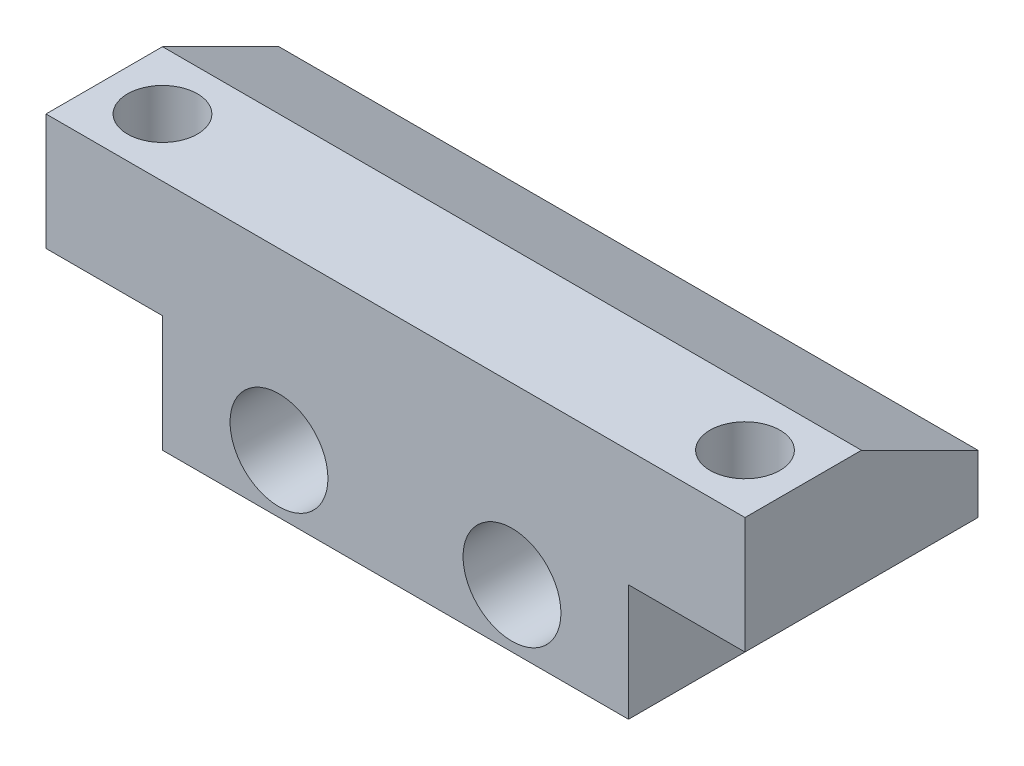
ISO-10303-21;
HEADER;
FILE_DESCRIPTION(('STEP AP214'),'2;1');
FILE_NAME('part.step','',(''),(''),'','','');
FILE_SCHEMA(('AUTOMOTIVE_DESIGN { 1 0 10303 214 1 1 1 1 }'));
ENDSEC;
DATA;
#1=APPLICATION_CONTEXT('core data for automotive mechanical design processes');
#2=APPLICATION_PROTOCOL_DEFINITION('international standard','automotive_design',2000,#1);
#3=PRODUCT_CONTEXT('',#1,'mechanical');
#4=PRODUCT('Part','Part','',(#3));
#5=PRODUCT_RELATED_PRODUCT_CATEGORY('part','',(#4));
#6=PRODUCT_DEFINITION_FORMATION('','',#4);
#7=PRODUCT_DEFINITION_CONTEXT('part definition',#1,'design');
#8=PRODUCT_DEFINITION('design','',#6,#7);
#9=PRODUCT_DEFINITION_SHAPE('','',#8);
#10=(LENGTH_UNIT() NAMED_UNIT(*) SI_UNIT(.MILLI.,.METRE.));
#11=(NAMED_UNIT(*) PLANE_ANGLE_UNIT() SI_UNIT($,.RADIAN.));
#12=(NAMED_UNIT(*) SI_UNIT($,.STERADIAN.) SOLID_ANGLE_UNIT());
#13=UNCERTAINTY_MEASURE_WITH_UNIT(LENGTH_MEASURE(1.E-05),#10,'distance_accuracy_value','');
#14=(GEOMETRIC_REPRESENTATION_CONTEXT(3) GLOBAL_UNCERTAINTY_ASSIGNED_CONTEXT((#13)) GLOBAL_UNIT_ASSIGNED_CONTEXT((#10,
#11,#12)) REPRESENTATION_CONTEXT('',''));
#15=CARTESIAN_POINT('',(0.,0.,0.));
#16=DIRECTION('',(0.,0.,1.));
#17=DIRECTION('',(1.,0.,0.));
#18=AXIS2_PLACEMENT_3D('',#15,#16,#17);
#19=CARTESIAN_POINT('',(0.,0.,0.));
#20=DIRECTION('',(0.,-1.,0.));
#21=DIRECTION('',(0.,0.,-1.));
#22=AXIS2_PLACEMENT_3D('',#19,#20,#21);
#23=PLANE('',#22);
#24=CARTESIAN_POINT('',(2.5,0.,-2.5));
#25=DIRECTION('',(0.,1.,0.));
#26=DIRECTION('',(0.,0.,1.));
#27=AXIS2_PLACEMENT_3D('',#24,#25,#26);
#28=CIRCLE('',#27,1.5);
#29=CARTESIAN_POINT('',(2.5,0.,-0.999999999999999));
#30=VERTEX_POINT('',#29);
#31=EDGE_CURVE('E172',#30,#30,#28,.T.);
#32=ORIENTED_EDGE('',*,*,#31,.T.);
#33=EDGE_LOOP('',(#32));
#34=FACE_BOUND('',#33,.T.);
#35=DIRECTION('',(0.,0.,-1.));
#36=VECTOR('',#35,1.);
#37=CARTESIAN_POINT('',(4.99999999999999,0.,0.));
#38=LINE('',#37,#36);
#39=CARTESIAN_POINT('',(4.99999999999999,0.,0.));
#40=VERTEX_POINT('',#39);
#41=CARTESIAN_POINT('',(4.99999999999999,0.,-10.));
#42=VERTEX_POINT('',#41);
#43=EDGE_CURVE('E193',#40,#42,#38,.T.);
#44=ORIENTED_EDGE('',*,*,#43,.F.);
#45=DIRECTION('',(1.,0.,0.));
#46=VECTOR('',#45,1.);
#47=CARTESIAN_POINT('',(0.,0.,0.));
#48=LINE('',#47,#46);
#49=CARTESIAN_POINT('',(0.,0.,0.));
#50=VERTEX_POINT('',#49);
#51=EDGE_CURVE('E236',#50,#40,#48,.T.);
#52=ORIENTED_EDGE('',*,*,#51,.F.);
#53=DIRECTION('',(0.,0.,1.));
#54=VECTOR('',#53,1.);
#55=CARTESIAN_POINT('',(0.,0.,0.));
#56=LINE('',#55,#54);
#57=CARTESIAN_POINT('',(0.,0.,-10.));
#58=VERTEX_POINT('',#57);
#59=EDGE_CURVE('E223',#58,#50,#56,.T.);
#60=ORIENTED_EDGE('',*,*,#59,.F.);
#61=DIRECTION('',(-1.,0.,0.));
#62=VECTOR('',#61,1.);
#63=CARTESIAN_POINT('',(0.,0.,-10.));
#64=LINE('',#63,#62);
#65=EDGE_CURVE('E242',#42,#58,#64,.T.);
#66=ORIENTED_EDGE('',*,*,#65,.F.);
#67=EDGE_LOOP('',(#44,#52,#60,#66));
#68=FACE_BOUND('',#67,.T.);
#69=ADVANCED_FACE('F38',(#34,#68),#23,.T.);
#70=CARTESIAN_POINT('',(0.,5.,0.));
#71=DIRECTION('',(1.,0.,0.));
#72=DIRECTION('',(0.,0.,-1.));
#73=AXIS2_PLACEMENT_3D('',#70,#71,#72);
#74=PLANE('',#73);
#75=DIRECTION('',(0.,0.,1.));
#76=VECTOR('',#75,1.);
#77=CARTESIAN_POINT('',(0.,5.,0.));
#78=LINE('',#77,#76);
#79=CARTESIAN_POINT('',(0.,5.,-4.99999999999996));
#80=VERTEX_POINT('',#79);
#81=CARTESIAN_POINT('',(0.,5.,0.));
#82=VERTEX_POINT('',#81);
#83=EDGE_CURVE('E224',#80,#82,#78,.T.);
#84=ORIENTED_EDGE('',*,*,#83,.F.);
#85=DIRECTION('',(0.,0.447213595499956,0.894427190999917));
#86=VECTOR('',#85,1.);
#87=CARTESIAN_POINT('',(0.,5.,-4.99999999999996));
#88=LINE('',#87,#86);
#89=CARTESIAN_POINT('',(0.,2.5,-10.));
#90=VERTEX_POINT('',#89);
#91=EDGE_CURVE('E61',#80,#90,#88,.F.);
#92=ORIENTED_EDGE('',*,*,#91,.T.);
#93=DIRECTION('',(0.,-1.,0.));
#94=VECTOR('',#93,1.);
#95=CARTESIAN_POINT('',(0.,5.,-10.));
#96=LINE('',#95,#94);
#97=EDGE_CURVE('E232',#90,#58,#96,.T.);
#98=ORIENTED_EDGE('',*,*,#97,.T.);
#99=ORIENTED_EDGE('',*,*,#59,.T.);
#100=DIRECTION('',(0.,-1.,0.));
#101=VECTOR('',#100,1.);
#102=CARTESIAN_POINT('',(0.,5.,0.));
#103=LINE('',#102,#101);
#104=EDGE_CURVE('E251',#82,#50,#103,.T.);
#105=ORIENTED_EDGE('',*,*,#104,.F.);
#106=EDGE_LOOP('',(#84,#92,#98,#99,#105));
#107=FACE_BOUND('',#106,.T.);
#108=ADVANCED_FACE('F265',(#107),#74,.F.);
#109=CARTESIAN_POINT('',(0.,5.,0.));
#110=DIRECTION('',(0.,0.,-1.));
#111=DIRECTION('',(-1.,0.,0.));
#112=AXIS2_PLACEMENT_3D('',#109,#110,#111);
#113=PLANE('',#112);
#114=CARTESIAN_POINT('',(9.99999999999999,-2.5,0.));
#115=DIRECTION('',(0.,0.,1.));
#116=DIRECTION('',(1.,0.,0.));
#117=AXIS2_PLACEMENT_3D('',#114,#115,#116);
#118=CIRCLE('',#117,2.1);
#119=CARTESIAN_POINT('',(12.1,-2.5,0.));
#120=VERTEX_POINT('',#119);
#121=EDGE_CURVE('E181',#120,#120,#118,.T.);
#122=ORIENTED_EDGE('',*,*,#121,.F.);
#123=EDGE_LOOP('',(#122));
#124=FACE_BOUND('',#123,.T.);
#125=CARTESIAN_POINT('',(20.,-2.5,0.));
#126=DIRECTION('',(0.,0.,1.));
#127=DIRECTION('',(1.,0.,0.));
#128=AXIS2_PLACEMENT_3D('',#125,#126,#127);
#129=CIRCLE('',#128,2.1);
#130=CARTESIAN_POINT('',(22.1,-2.5,0.));
#131=VERTEX_POINT('',#130);
#132=EDGE_CURVE('E187',#131,#131,#129,.T.);
#133=ORIENTED_EDGE('',*,*,#132,.F.);
#134=EDGE_LOOP('',(#133));
#135=FACE_BOUND('',#134,.T.);
#136=ORIENTED_EDGE('',*,*,#51,.T.);
#137=DIRECTION('',(0.,1.,0.));
#138=VECTOR('',#137,1.);
#139=CARTESIAN_POINT('',(4.99999999999999,-5.,0.));
#140=LINE('',#139,#138);
#141=CARTESIAN_POINT('',(4.99999999999999,-5.,0.));
#142=VERTEX_POINT('',#141);
#143=EDGE_CURVE('E207',#142,#40,#140,.T.);
#144=ORIENTED_EDGE('',*,*,#143,.F.);
#145=DIRECTION('',(-1.,0.,0.));
#146=VECTOR('',#145,1.);
#147=CARTESIAN_POINT('',(4.99999999999999,-5.,0.));
#148=LINE('',#147,#146);
#149=CARTESIAN_POINT('',(25.,-5.,0.));
#150=VERTEX_POINT('',#149);
#151=EDGE_CURVE('E205',#150,#142,#148,.T.);
#152=ORIENTED_EDGE('',*,*,#151,.F.);
#153=DIRECTION('',(0.,1.,0.));
#154=VECTOR('',#153,1.);
#155=CARTESIAN_POINT('',(25.,-5.,0.));
#156=LINE('',#155,#154);
#157=CARTESIAN_POINT('',(25.,0.,0.));
#158=VERTEX_POINT('',#157);
#159=EDGE_CURVE('E214',#150,#158,#156,.T.);
#160=ORIENTED_EDGE('',*,*,#159,.T.);
#161=CARTESIAN_POINT('',(30.,0.,0.));
#162=VERTEX_POINT('',#161);
#163=EDGE_CURVE('E235',#158,#162,#48,.T.);
#164=ORIENTED_EDGE('',*,*,#163,.T.);
#165=DIRECTION('',(0.,-1.,0.));
#166=VECTOR('',#165,1.);
#167=CARTESIAN_POINT('',(30.,5.,0.));
#168=LINE('',#167,#166);
#169=CARTESIAN_POINT('',(30.,5.,0.));
#170=VERTEX_POINT('',#169);
#171=EDGE_CURVE('E248',#170,#162,#168,.T.);
#172=ORIENTED_EDGE('',*,*,#171,.F.);
#173=DIRECTION('',(1.,0.,0.));
#174=VECTOR('',#173,1.);
#175=CARTESIAN_POINT('',(0.,5.,0.));
#176=LINE('',#175,#174);
#177=EDGE_CURVE('E226',#82,#170,#176,.T.);
#178=ORIENTED_EDGE('',*,*,#177,.F.);
#179=ORIENTED_EDGE('',*,*,#104,.T.);
#180=EDGE_LOOP('',(#136,#144,#152,#160,#164,#172,#178,#179));
#181=FACE_BOUND('',#180,.T.);
#182=ADVANCED_FACE('F268',(#124,#135,#181),#113,.F.);
#183=CARTESIAN_POINT('',(30.,5.,0.));
#184=DIRECTION('',(-1.,0.,0.));
#185=DIRECTION('',(0.,0.,1.));
#186=AXIS2_PLACEMENT_3D('',#183,#184,#185);
#187=PLANE('',#186);
#188=DIRECTION('',(0.,-1.,0.));
#189=VECTOR('',#188,1.);
#190=CARTESIAN_POINT('',(30.,5.,-10.));
#191=LINE('',#190,#189);
#192=CARTESIAN_POINT('',(30.,2.5,-10.));
#193=VERTEX_POINT('',#192);
#194=CARTESIAN_POINT('',(30.,0.,-10.));
#195=VERTEX_POINT('',#194);
#196=EDGE_CURVE('E246',#193,#195,#191,.T.);
#197=ORIENTED_EDGE('',*,*,#196,.F.);
#198=DIRECTION('',(0.,-0.447213595499956,-0.894427190999917));
#199=VECTOR('',#198,1.);
#200=CARTESIAN_POINT('',(30.,4.99999999999999,-4.99999999999998));
#201=LINE('',#200,#199);
#202=CARTESIAN_POINT('',(30.,5.,-4.99999999999996));
#203=VERTEX_POINT('',#202);
#204=EDGE_CURVE('E11',#193,#203,#201,.F.);
#205=ORIENTED_EDGE('',*,*,#204,.T.);
#206=DIRECTION('',(0.,0.,-1.));
#207=VECTOR('',#206,1.);
#208=CARTESIAN_POINT('',(30.,5.,0.));
#209=LINE('',#208,#207);
#210=EDGE_CURVE('E229',#170,#203,#209,.T.);
#211=ORIENTED_EDGE('',*,*,#210,.F.);
#212=ORIENTED_EDGE('',*,*,#171,.T.);
#213=DIRECTION('',(0.,0.,-1.));
#214=VECTOR('',#213,1.);
#215=CARTESIAN_POINT('',(30.,0.,0.));
#216=LINE('',#215,#214);
#217=EDGE_CURVE('E239',#162,#195,#216,.T.);
#218=ORIENTED_EDGE('',*,*,#217,.T.);
#219=EDGE_LOOP('',(#197,#205,#211,#212,#218));
#220=FACE_BOUND('',#219,.T.);
#221=ADVANCED_FACE('F273',(#220),#187,.F.);
#222=CARTESIAN_POINT('',(0.,5.,-10.));
#223=DIRECTION('',(0.,0.,1.));
#224=DIRECTION('',(1.,0.,0.));
#225=AXIS2_PLACEMENT_3D('',#222,#223,#224);
#226=PLANE('',#225);
#227=CARTESIAN_POINT('',(9.99999999999999,-2.5,-10.));
#228=DIRECTION('',(0.,0.,1.));
#229=DIRECTION('',(1.,0.,0.));
#230=AXIS2_PLACEMENT_3D('',#227,#228,#229);
#231=CIRCLE('',#230,2.1);
#232=CARTESIAN_POINT('',(12.1,-2.5,-10.));
#233=VERTEX_POINT('',#232);
#234=EDGE_CURVE('E184',#233,#233,#231,.T.);
#235=ORIENTED_EDGE('',*,*,#234,.T.);
#236=EDGE_LOOP('',(#235));
#237=FACE_BOUND('',#236,.T.);
#238=CARTESIAN_POINT('',(20.,-2.5,-10.));
#239=DIRECTION('',(0.,0.,1.));
#240=DIRECTION('',(1.,0.,0.));
#241=AXIS2_PLACEMENT_3D('',#238,#239,#240);
#242=CIRCLE('',#241,2.1);
#243=CARTESIAN_POINT('',(22.1,-2.5,-10.));
#244=VERTEX_POINT('',#243);
#245=EDGE_CURVE('E190',#244,#244,#242,.T.);
#246=ORIENTED_EDGE('',*,*,#245,.T.);
#247=EDGE_LOOP('',(#246));
#248=FACE_BOUND('',#247,.T.);
#249=ORIENTED_EDGE('',*,*,#97,.F.);
#250=DIRECTION('',(1.,0.,0.));
#251=VECTOR('',#250,1.);
#252=CARTESIAN_POINT('',(0.,2.5,-10.));
#253=LINE('',#252,#251);
#254=EDGE_CURVE('E47',#90,#193,#253,.T.);
#255=ORIENTED_EDGE('',*,*,#254,.T.);
#256=ORIENTED_EDGE('',*,*,#196,.T.);
#257=CARTESIAN_POINT('',(25.,0.,-10.));
#258=VERTEX_POINT('',#257);
#259=EDGE_CURVE('E227',#195,#258,#64,.T.);
#260=ORIENTED_EDGE('',*,*,#259,.T.);
#261=DIRECTION('',(0.,1.,0.));
#262=VECTOR('',#261,1.);
#263=CARTESIAN_POINT('',(25.,-5.,-10.));
#264=LINE('',#263,#262);
#265=CARTESIAN_POINT('',(25.,-5.,-10.));
#266=VERTEX_POINT('',#265);
#267=EDGE_CURVE('E217',#266,#258,#264,.T.);
#268=ORIENTED_EDGE('',*,*,#267,.F.);
#269=DIRECTION('',(1.,0.,0.));
#270=VECTOR('',#269,1.);
#271=CARTESIAN_POINT('',(4.99999999999999,-5.,-10.));
#272=LINE('',#271,#270);
#273=CARTESIAN_POINT('',(15.75,-5.,-10.));
#274=VERTEX_POINT('',#273);
#275=EDGE_CURVE('E199',#274,#266,#272,.T.);
#276=ORIENTED_EDGE('',*,*,#275,.F.);
#277=DIRECTION('',(0.,-1.,0.));
#278=VECTOR('',#277,1.);
#279=CARTESIAN_POINT('',(15.75,0.,-10.));
#280=LINE('',#279,#278);
#281=CARTESIAN_POINT('',(15.75,0.,-10.));
#282=VERTEX_POINT('',#281);
#283=EDGE_CURVE('E141',#282,#274,#280,.T.);
#284=ORIENTED_EDGE('',*,*,#283,.F.);
#285=DIRECTION('',(1.,0.,0.));
#286=VECTOR('',#285,1.);
#287=CARTESIAN_POINT('',(14.25,0.,-10.));
#288=LINE('',#287,#286);
#289=CARTESIAN_POINT('',(14.25,0.,-10.));
#290=VERTEX_POINT('',#289);
#291=EDGE_CURVE('E148',#290,#282,#288,.T.);
#292=ORIENTED_EDGE('',*,*,#291,.F.);
#293=DIRECTION('',(0.,-1.,0.));
#294=VECTOR('',#293,1.);
#295=CARTESIAN_POINT('',(14.25,0.,-10.));
#296=LINE('',#295,#294);
#297=CARTESIAN_POINT('',(14.25,-5.,-10.));
#298=VERTEX_POINT('',#297);
#299=EDGE_CURVE('E132',#290,#298,#296,.T.);
#300=ORIENTED_EDGE('',*,*,#299,.T.);
#301=CARTESIAN_POINT('',(4.99999999999999,-5.,-10.));
#302=VERTEX_POINT('',#301);
#303=EDGE_CURVE('E201',#302,#298,#272,.T.);
#304=ORIENTED_EDGE('',*,*,#303,.F.);
#305=DIRECTION('',(0.,1.,0.));
#306=VECTOR('',#305,1.);
#307=CARTESIAN_POINT('',(4.99999999999999,-5.,-10.));
#308=LINE('',#307,#306);
#309=EDGE_CURVE('E220',#302,#42,#308,.T.);
#310=ORIENTED_EDGE('',*,*,#309,.T.);
#311=ORIENTED_EDGE('',*,*,#65,.T.);
#312=EDGE_LOOP('',(#249,#255,#256,#260,#268,#276,#284,#292,#300,#304,#310,#311));
#313=FACE_BOUND('',#312,.T.);
#314=ADVANCED_FACE('F153',(#237,#248,#313),#226,.F.);
#315=CARTESIAN_POINT('',(0.,5.,0.));
#316=DIRECTION('',(0.,-1.,0.));
#317=DIRECTION('',(0.,0.,-1.));
#318=AXIS2_PLACEMENT_3D('',#315,#316,#317);
#319=PLANE('',#318);
#320=CARTESIAN_POINT('',(2.5,5.,-2.5));
#321=DIRECTION('',(0.,1.,0.));
#322=DIRECTION('',(0.,0.,1.));
#323=AXIS2_PLACEMENT_3D('',#320,#321,#322);
#324=CIRCLE('',#323,1.5);
#325=CARTESIAN_POINT('',(2.5,5.,-0.999999999999999));
#326=VERTEX_POINT('',#325);
#327=EDGE_CURVE('E168',#326,#326,#324,.T.);
#328=ORIENTED_EDGE('',*,*,#327,.F.);
#329=EDGE_LOOP('',(#328));
#330=FACE_BOUND('',#329,.T.);
#331=CARTESIAN_POINT('',(27.5,5.,-2.5));
#332=DIRECTION('',(0.,1.,0.));
#333=DIRECTION('',(0.,0.,1.));
#334=AXIS2_PLACEMENT_3D('',#331,#332,#333);
#335=CIRCLE('',#334,1.5);
#336=CARTESIAN_POINT('',(27.5,5.,-0.999999999999999));
#337=VERTEX_POINT('',#336);
#338=EDGE_CURVE('E175',#337,#337,#335,.T.);
#339=ORIENTED_EDGE('',*,*,#338,.F.);
#340=EDGE_LOOP('',(#339));
#341=FACE_BOUND('',#340,.T.);
#342=ORIENTED_EDGE('',*,*,#210,.T.);
#343=DIRECTION('',(-1.,0.,0.));
#344=VECTOR('',#343,1.);
#345=CARTESIAN_POINT('',(0.,5.,-4.99999999999996));
#346=LINE('',#345,#344);
#347=EDGE_CURVE('E254',#203,#80,#346,.T.);
#348=ORIENTED_EDGE('',*,*,#347,.T.);
#349=ORIENTED_EDGE('',*,*,#83,.T.);
#350=ORIENTED_EDGE('',*,*,#177,.T.);
#351=EDGE_LOOP('',(#342,#348,#349,#350));
#352=FACE_BOUND('',#351,.T.);
#353=ADVANCED_FACE('F259',(#330,#341,#352),#319,.F.);
#354=CARTESIAN_POINT('',(27.5,0.,-2.5));
#355=DIRECTION('',(0.,1.,0.));
#356=DIRECTION('',(0.,0.,1.));
#357=AXIS2_PLACEMENT_3D('',#354,#355,#356);
#358=CIRCLE('',#357,1.5);
#359=CARTESIAN_POINT('',(27.5,0.,-0.999999999999999));
#360=VERTEX_POINT('',#359);
#361=EDGE_CURVE('E178',#360,#360,#358,.T.);
#362=ORIENTED_EDGE('',*,*,#361,.T.);
#363=EDGE_LOOP('',(#362));
#364=FACE_BOUND('',#363,.T.);
#365=DIRECTION('',(0.,0.,1.));
#366=VECTOR('',#365,1.);
#367=CARTESIAN_POINT('',(25.,0.,0.));
#368=LINE('',#367,#366);
#369=EDGE_CURVE('E200',#258,#158,#368,.T.);
#370=ORIENTED_EDGE('',*,*,#369,.F.);
#371=ORIENTED_EDGE('',*,*,#259,.F.);
#372=ORIENTED_EDGE('',*,*,#217,.F.);
#373=ORIENTED_EDGE('',*,*,#163,.F.);
#374=EDGE_LOOP('',(#370,#371,#372,#373));
#375=FACE_BOUND('',#374,.T.);
#376=ADVANCED_FACE('F283',(#364,#375),#23,.T.);
#377=CARTESIAN_POINT('',(4.99999999999999,-5.,0.));
#378=DIRECTION('',(1.,0.,0.));
#379=DIRECTION('',(0.,0.,-1.));
#380=AXIS2_PLACEMENT_3D('',#377,#378,#379);
#381=PLANE('',#380);
#382=ORIENTED_EDGE('',*,*,#43,.T.);
#383=ORIENTED_EDGE('',*,*,#309,.F.);
#384=DIRECTION('',(0.,0.,-1.));
#385=VECTOR('',#384,1.);
#386=CARTESIAN_POINT('',(4.99999999999999,-5.,0.));
#387=LINE('',#386,#385);
#388=EDGE_CURVE('E196',#142,#302,#387,.T.);
#389=ORIENTED_EDGE('',*,*,#388,.F.);
#390=ORIENTED_EDGE('',*,*,#143,.T.);
#391=EDGE_LOOP('',(#382,#383,#389,#390));
#392=FACE_BOUND('',#391,.T.);
#393=ADVANCED_FACE('F291',(#392),#381,.F.);
#394=CARTESIAN_POINT('',(25.,-5.,0.));
#395=DIRECTION('',(-1.,0.,0.));
#396=DIRECTION('',(0.,0.,1.));
#397=AXIS2_PLACEMENT_3D('',#394,#395,#396);
#398=PLANE('',#397);
#399=ORIENTED_EDGE('',*,*,#369,.T.);
#400=ORIENTED_EDGE('',*,*,#159,.F.);
#401=DIRECTION('',(0.,0.,1.));
#402=VECTOR('',#401,1.);
#403=CARTESIAN_POINT('',(25.,-5.,0.));
#404=LINE('',#403,#402);
#405=EDGE_CURVE('E203',#266,#150,#404,.T.);
#406=ORIENTED_EDGE('',*,*,#405,.F.);
#407=ORIENTED_EDGE('',*,*,#267,.T.);
#408=EDGE_LOOP('',(#399,#400,#406,#407));
#409=FACE_BOUND('',#408,.T.);
#410=ADVANCED_FACE('F297',(#409),#398,.F.);
#411=CARTESIAN_POINT('',(0.,-5.,0.));
#412=DIRECTION('',(0.,-1.,0.));
#413=DIRECTION('',(0.,0.,-1.));
#414=AXIS2_PLACEMENT_3D('',#411,#412,#413);
#415=PLANE('',#414);
#416=DIRECTION('',(0.,0.,-1.));
#417=VECTOR('',#416,1.);
#418=CARTESIAN_POINT('',(14.25,-5.,-10.));
#419=LINE('',#418,#417);
#420=CARTESIAN_POINT('',(14.25,-5.,-8.5));
#421=VERTEX_POINT('',#420);
#422=EDGE_CURVE('E138',#421,#298,#419,.T.);
#423=ORIENTED_EDGE('',*,*,#422,.F.);
#424=DIRECTION('',(-1.,0.,0.));
#425=VECTOR('',#424,1.);
#426=CARTESIAN_POINT('',(14.25,-5.,-8.5));
#427=LINE('',#426,#425);
#428=CARTESIAN_POINT('',(15.75,-5.,-8.5));
#429=VERTEX_POINT('',#428);
#430=EDGE_CURVE('E151',#429,#421,#427,.T.);
#431=ORIENTED_EDGE('',*,*,#430,.F.);
#432=DIRECTION('',(0.,0.,1.));
#433=VECTOR('',#432,1.);
#434=CARTESIAN_POINT('',(15.75,-5.,-10.));
#435=LINE('',#434,#433);
#436=EDGE_CURVE('E161',#274,#429,#435,.T.);
#437=ORIENTED_EDGE('',*,*,#436,.F.);
#438=ORIENTED_EDGE('',*,*,#275,.T.);
#439=ORIENTED_EDGE('',*,*,#405,.T.);
#440=ORIENTED_EDGE('',*,*,#151,.T.);
#441=ORIENTED_EDGE('',*,*,#388,.T.);
#442=ORIENTED_EDGE('',*,*,#303,.T.);
#443=EDGE_LOOP('',(#423,#431,#437,#438,#439,#440,#441,#442));
#444=FACE_BOUND('',#443,.T.);
#445=ADVANCED_FACE('F310',(#444),#415,.T.);
#446=CARTESIAN_POINT('',(20.,-2.5,-10.));
#447=DIRECTION('',(0.,0.,1.));
#448=DIRECTION('',(1.,0.,0.));
#449=AXIS2_PLACEMENT_3D('',#446,#447,#448);
#450=CYLINDRICAL_SURFACE('',#449,2.1);
#451=ORIENTED_EDGE('',*,*,#245,.F.);
#452=EDGE_LOOP('',(#451));
#453=FACE_BOUND('',#452,.T.);
#454=ORIENTED_EDGE('',*,*,#132,.T.);
#455=EDGE_LOOP('',(#454));
#456=FACE_BOUND('',#455,.T.);
#457=ADVANCED_FACE('F339',(#453,#456),#450,.F.);
#458=CARTESIAN_POINT('',(9.99999999999999,-2.5,-10.));
#459=DIRECTION('',(0.,0.,1.));
#460=DIRECTION('',(1.,0.,0.));
#461=AXIS2_PLACEMENT_3D('',#458,#459,#460);
#462=CYLINDRICAL_SURFACE('',#461,2.1);
#463=ORIENTED_EDGE('',*,*,#234,.F.);
#464=EDGE_LOOP('',(#463));
#465=FACE_BOUND('',#464,.T.);
#466=ORIENTED_EDGE('',*,*,#121,.T.);
#467=EDGE_LOOP('',(#466));
#468=FACE_BOUND('',#467,.T.);
#469=ADVANCED_FACE('F335',(#465,#468),#462,.F.);
#470=CARTESIAN_POINT('',(27.5,0.,-2.5));
#471=DIRECTION('',(0.,1.,0.));
#472=DIRECTION('',(0.,0.,1.));
#473=AXIS2_PLACEMENT_3D('',#470,#471,#472);
#474=CYLINDRICAL_SURFACE('',#473,1.5);
#475=ORIENTED_EDGE('',*,*,#361,.F.);
#476=EDGE_LOOP('',(#475));
#477=FACE_BOUND('',#476,.T.);
#478=ORIENTED_EDGE('',*,*,#338,.T.);
#479=EDGE_LOOP('',(#478));
#480=FACE_BOUND('',#479,.T.);
#481=ADVANCED_FACE('F331',(#477,#480),#474,.F.);
#482=CARTESIAN_POINT('',(2.5,0.,-2.5));
#483=DIRECTION('',(0.,1.,0.));
#484=DIRECTION('',(0.,0.,1.));
#485=AXIS2_PLACEMENT_3D('',#482,#483,#484);
#486=CYLINDRICAL_SURFACE('',#485,1.5);
#487=ORIENTED_EDGE('',*,*,#31,.F.);
#488=EDGE_LOOP('',(#487));
#489=FACE_BOUND('',#488,.T.);
#490=ORIENTED_EDGE('',*,*,#327,.T.);
#491=EDGE_LOOP('',(#490));
#492=FACE_BOUND('',#491,.T.);
#493=ADVANCED_FACE('F326',(#489,#492),#486,.F.);
#494=CARTESIAN_POINT('',(14.25,0.,-10.));
#495=DIRECTION('',(-1.,0.,0.));
#496=DIRECTION('',(0.,0.,1.));
#497=AXIS2_PLACEMENT_3D('',#494,#495,#496);
#498=PLANE('',#497);
#499=ORIENTED_EDGE('',*,*,#422,.T.);
#500=ORIENTED_EDGE('',*,*,#299,.F.);
#501=DIRECTION('',(0.,0.,-1.));
#502=VECTOR('',#501,1.);
#503=CARTESIAN_POINT('',(14.25,0.,-10.));
#504=LINE('',#503,#502);
#505=CARTESIAN_POINT('',(14.25,0.,-8.5));
#506=VERTEX_POINT('',#505);
#507=EDGE_CURVE('E135',#506,#290,#504,.T.);
#508=ORIENTED_EDGE('',*,*,#507,.F.);
#509=DIRECTION('',(0.,-1.,0.));
#510=VECTOR('',#509,1.);
#511=CARTESIAN_POINT('',(14.25,0.,-8.5));
#512=LINE('',#511,#510);
#513=EDGE_CURVE('E166',#506,#421,#512,.T.);
#514=ORIENTED_EDGE('',*,*,#513,.T.);
#515=EDGE_LOOP('',(#499,#500,#508,#514));
#516=FACE_BOUND('',#515,.T.);
#517=ADVANCED_FACE('F134',(#516),#498,.F.);
#518=CARTESIAN_POINT('',(14.25,0.,-8.5));
#519=DIRECTION('',(0.,0.,1.));
#520=DIRECTION('',(1.,0.,0.));
#521=AXIS2_PLACEMENT_3D('',#518,#519,#520);
#522=PLANE('',#521);
#523=ORIENTED_EDGE('',*,*,#430,.T.);
#524=ORIENTED_EDGE('',*,*,#513,.F.);
#525=DIRECTION('',(-1.,0.,0.));
#526=VECTOR('',#525,1.);
#527=CARTESIAN_POINT('',(14.25,0.,-8.5));
#528=LINE('',#527,#526);
#529=CARTESIAN_POINT('',(15.75,0.,-8.5));
#530=VERTEX_POINT('',#529);
#531=EDGE_CURVE('E142',#530,#506,#528,.T.);
#532=ORIENTED_EDGE('',*,*,#531,.F.);
#533=DIRECTION('',(0.,-1.,0.));
#534=VECTOR('',#533,1.);
#535=CARTESIAN_POINT('',(15.75,0.,-8.5));
#536=LINE('',#535,#534);
#537=EDGE_CURVE('E169',#530,#429,#536,.T.);
#538=ORIENTED_EDGE('',*,*,#537,.T.);
#539=EDGE_LOOP('',(#523,#524,#532,#538));
#540=FACE_BOUND('',#539,.T.);
#541=ADVANCED_FACE('F315',(#540),#522,.F.);
#542=CARTESIAN_POINT('',(15.75,0.,-10.));
#543=DIRECTION('',(1.,0.,0.));
#544=DIRECTION('',(0.,0.,-1.));
#545=AXIS2_PLACEMENT_3D('',#542,#543,#544);
#546=PLANE('',#545);
#547=ORIENTED_EDGE('',*,*,#436,.T.);
#548=ORIENTED_EDGE('',*,*,#537,.F.);
#549=DIRECTION('',(0.,0.,1.));
#550=VECTOR('',#549,1.);
#551=CARTESIAN_POINT('',(15.75,0.,-10.));
#552=LINE('',#551,#550);
#553=EDGE_CURVE('E155',#282,#530,#552,.T.);
#554=ORIENTED_EDGE('',*,*,#553,.F.);
#555=ORIENTED_EDGE('',*,*,#283,.T.);
#556=EDGE_LOOP('',(#547,#548,#554,#555));
#557=FACE_BOUND('',#556,.T.);
#558=ADVANCED_FACE('F278',(#557),#546,.F.);
#559=CARTESIAN_POINT('',(0.,0.,0.));
#560=DIRECTION('',(0.,1.,0.));
#561=DIRECTION('',(0.,0.,1.));
#562=AXIS2_PLACEMENT_3D('',#559,#560,#561);
#563=PLANE('',#562);
#564=ORIENTED_EDGE('',*,*,#507,.T.);
#565=ORIENTED_EDGE('',*,*,#291,.T.);
#566=ORIENTED_EDGE('',*,*,#553,.T.);
#567=ORIENTED_EDGE('',*,*,#531,.T.);
#568=EDGE_LOOP('',(#564,#565,#566,#567));
#569=FACE_BOUND('',#568,.T.);
#570=ADVANCED_FACE('F146',(#569),#563,.F.);
#571=CARTESIAN_POINT('',(0.,5.,-4.99999999999996));
#572=DIRECTION('',(0.,-0.894427190999917,0.447213595499956));
#573=DIRECTION('',(-1.,0.,0.));
#574=AXIS2_PLACEMENT_3D('',#571,#572,#573);
#575=PLANE('',#574);
#576=ORIENTED_EDGE('',*,*,#204,.F.);
#577=ORIENTED_EDGE('',*,*,#254,.F.);
#578=ORIENTED_EDGE('',*,*,#91,.F.);
#579=ORIENTED_EDGE('',*,*,#347,.F.);
#580=EDGE_LOOP('',(#576,#577,#578,#579));
#581=FACE_BOUND('',#580,.T.);
#582=ADVANCED_FACE('F41',(#581),#575,.F.);
#583=CLOSED_SHELL('',(#69,#108,#182,#221,#314,#353,#376,#393,#410,#445,#457,#469,#481,#493,#517,
#541,#558,#570,#582));
#584=MANIFOLD_SOLID_BREP('B2',#583);
#585=ADVANCED_BREP_SHAPE_REPRESENTATION('',(#18,#584),#14);
#586=SHAPE_DEFINITION_REPRESENTATION(#9,#585);
ENDSEC;
END-ISO-10303-21;
